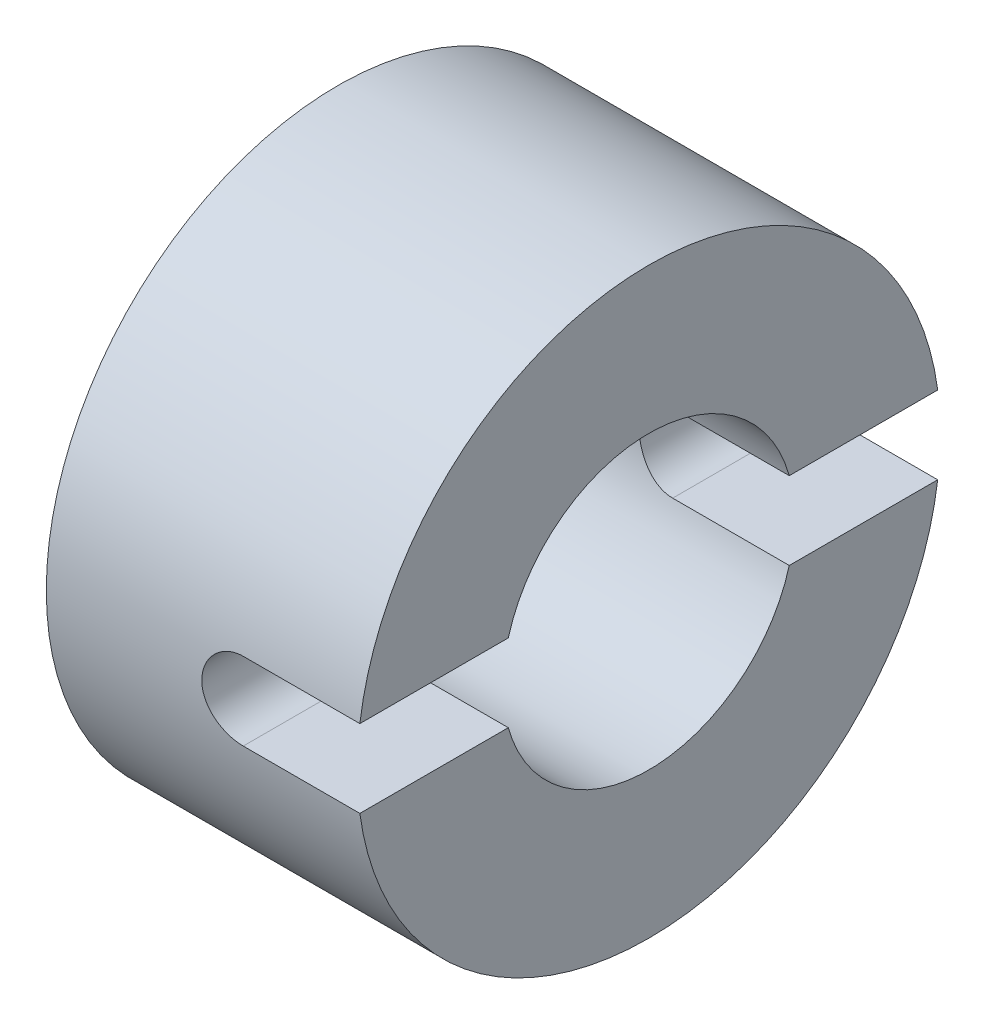
ISO-10303-21;
HEADER;
FILE_DESCRIPTION(('STEP AP214'),'2;1');
FILE_NAME('part.step','',(''),(''),'','','');
FILE_SCHEMA(('AUTOMOTIVE_DESIGN { 1 0 10303 214 1 1 1 1 }'));
ENDSEC;
DATA;
#1=APPLICATION_CONTEXT('core data for automotive mechanical design processes');
#2=APPLICATION_PROTOCOL_DEFINITION('international standard','automotive_design',2000,#1);
#3=PRODUCT_CONTEXT('',#1,'mechanical');
#4=PRODUCT('Part','Part','',(#3));
#5=PRODUCT_RELATED_PRODUCT_CATEGORY('part','',(#4));
#6=PRODUCT_DEFINITION_FORMATION('','',#4);
#7=PRODUCT_DEFINITION_CONTEXT('part definition',#1,'design');
#8=PRODUCT_DEFINITION('design','',#6,#7);
#9=PRODUCT_DEFINITION_SHAPE('','',#8);
#10=(LENGTH_UNIT() NAMED_UNIT(*) SI_UNIT(.MILLI.,.METRE.));
#11=(NAMED_UNIT(*) PLANE_ANGLE_UNIT() SI_UNIT($,.RADIAN.));
#12=(NAMED_UNIT(*) SI_UNIT($,.STERADIAN.) SOLID_ANGLE_UNIT());
#13=UNCERTAINTY_MEASURE_WITH_UNIT(LENGTH_MEASURE(1.E-05),#10,'distance_accuracy_value','');
#14=(GEOMETRIC_REPRESENTATION_CONTEXT(3) GLOBAL_UNCERTAINTY_ASSIGNED_CONTEXT((#13)) GLOBAL_UNIT_ASSIGNED_CONTEXT((#10,
#11,#12)) REPRESENTATION_CONTEXT('',''));
#15=CARTESIAN_POINT('',(0.,0.,0.));
#16=DIRECTION('',(0.,0.,1.));
#17=DIRECTION('',(1.,0.,0.));
#18=AXIS2_PLACEMENT_3D('',#15,#16,#17);
#19=CARTESIAN_POINT('',(-26.499793814433,0.,0.));
#20=DIRECTION('',(-1.,0.,0.));
#21=DIRECTION('',(0.,0.,1.));
#22=AXIS2_PLACEMENT_3D('',#19,#20,#21);
#23=CYLINDRICAL_SURFACE('',#22,7.5);
#24=CARTESIAN_POINT('',(-12.673814,0.,0.));
#25=DIRECTION('',(-1.,0.,0.));
#26=DIRECTION('',(0.,0.,1.));
#27=AXIS2_PLACEMENT_3D('',#24,#25,#26);
#28=CIRCLE('',#27,7.5);
#29=CARTESIAN_POINT('',(-12.673814,0.,7.5));
#30=VERTEX_POINT('',#29);
#31=EDGE_CURVE('E136',#30,#30,#28,.T.);
#32=ORIENTED_EDGE('',*,*,#31,.F.);
#33=EDGE_LOOP('',(#32));
#34=FACE_BOUND('',#33,.T.);
#35=DIRECTION('',(-1.,0.,0.));
#36=VECTOR('',#35,1.);
#37=CARTESIAN_POINT('',(-26.499793814433,1.,7.43303437365925));
#38=LINE('',#37,#36);
#39=CARTESIAN_POINT('',(-4.673814,1.,7.43303437365925));
#40=VERTEX_POINT('',#39);
#41=CARTESIAN_POINT('',(-7.673814,1.,7.43303437365925));
#42=VERTEX_POINT('',#41);
#43=EDGE_CURVE('E121',#40,#42,#38,.T.);
#44=ORIENTED_EDGE('',*,*,#43,.F.);
#45=CARTESIAN_POINT('',(-4.673814,0.,0.));
#46=DIRECTION('',(-1.,0.,0.));
#47=DIRECTION('',(0.,0.,1.));
#48=AXIS2_PLACEMENT_3D('',#45,#46,#47);
#49=CIRCLE('',#48,7.5);
#50=CARTESIAN_POINT('',(-4.673814,1.,-7.43303437365925));
#51=VERTEX_POINT('',#50);
#52=EDGE_CURVE('E117',#40,#51,#49,.T.);
#53=ORIENTED_EDGE('',*,*,#52,.T.);
#54=DIRECTION('',(-1.,0.,0.));
#55=VECTOR('',#54,1.);
#56=CARTESIAN_POINT('',(-26.499793814433,1.,-7.43303437365925));
#57=LINE('',#56,#55);
#58=CARTESIAN_POINT('',(-7.673814,1.,-7.43303437365925));
#59=VERTEX_POINT('',#58);
#60=EDGE_CURVE('E107',#59,#51,#57,.F.);
#61=ORIENTED_EDGE('',*,*,#60,.F.);
#62=CARTESIAN_POINT('',(-6.673814,0.,-7.5));
#63=CARTESIAN_POINT('',(-6.67381635485345,0.0559044178346422,-7.49999917871272));
#64=CARTESIAN_POINT('',(-6.67851776898123,0.11184298963814,-7.49936835363597));
#65=CARTESIAN_POINT('',(-6.69719717452478,0.222161362569039,-7.49691255563452));
#66=CARTESIAN_POINT('',(-6.71118464744857,0.276539511166518,-7.49508636220862));
#67=CARTESIAN_POINT('',(-6.74801485877072,0.382124156313492,-7.49044539924533));
#68=CARTESIAN_POINT('',(-6.77085140551922,0.433332841529247,-7.48763132105486));
#69=CARTESIAN_POINT('',(-6.82471745690314,0.531181947515149,-7.48132693330196));
#70=CARTESIAN_POINT('',(-6.85574564058323,0.577823103168513,-7.47783673279283));
#71=CARTESIAN_POINT('',(-6.92532063080209,0.665512911252339,-7.47054497394982));
#72=CARTESIAN_POINT('',(-6.96390832250423,0.706528992747932,-7.46674179081055));
#73=CARTESIAN_POINT('',(-7.04741909453833,0.781523678365509,-7.45926568778975));
#74=CARTESIAN_POINT('',(-7.0923425099979,0.815501909986106,-7.45559277481171));
#75=CARTESIAN_POINT('',(-7.18746356147251,0.875579511344537,-7.44877717720095));
#76=CARTESIAN_POINT('',(-7.23768084123931,0.901648037412889,-7.44563658882881));
#77=CARTESIAN_POINT('',(-7.34182953361839,0.944969225036451,-7.44026293689616));
#78=CARTESIAN_POINT('',(-7.39576078617666,0.96222226622639,-7.43802983425604));
#79=CARTESIAN_POINT('',(-7.50546690525083,0.987323033860869,-7.43473968284334));
#80=CARTESIAN_POINT('',(-7.56122891726646,0.995226021142532,-7.43367572685068));
#81=CARTESIAN_POINT('',(-7.67329708980297,1.00157340274059,-7.43282325804657));
#82=CARTESIAN_POINT('',(-7.72960322540545,1.00001822816801,-7.433034687102));
#83=CARTESIAN_POINT('',(-7.84077456501396,0.987538729696172,-7.43470277886495));
#84=CARTESIAN_POINT('',(-7.89564676494285,0.976675487658808,-7.43615132311171));
#85=CARTESIAN_POINT('',(-8.00278241838004,0.945983623171857,-7.44011776387373));
#86=CARTESIAN_POINT('',(-8.0550458123775,0.926154796307287,-7.44263568477064));
#87=CARTESIAN_POINT('',(-8.1556688173536,0.878029645715956,-7.44846630555513));
#88=CARTESIAN_POINT('',(-8.20401568559715,0.849706989568746,-7.45178147061949));
#89=CARTESIAN_POINT('',(-8.29529354095883,0.785416966721446,-7.45883118109967));
#90=CARTESIAN_POINT('',(-8.33822424627708,0.749449202511925,-7.46256574831765));
#91=CARTESIAN_POINT('',(-8.41780550629095,0.670552450131812,-7.47006949616793));
#92=CARTESIAN_POINT('',(-8.45440392135116,0.627570853513222,-7.47383871770599));
#93=CARTESIAN_POINT('',(-8.51987502246419,0.536047085066703,-7.48095961909132));
#94=CARTESIAN_POINT('',(-8.54874768626176,0.487504897221184,-7.48431129773577));
#95=CARTESIAN_POINT('',(-8.59794855884737,0.386196109865234,-7.4902219687179));
#96=CARTESIAN_POINT('',(-8.61827326552315,0.333427789420614,-7.49278063604478));
#97=CARTESIAN_POINT('',(-8.64975865948617,0.225185462168124,-7.49681412952036));
#98=CARTESIAN_POINT('',(-8.66091983531969,0.169711599771128,-7.49828901344964));
#99=CARTESIAN_POINT('',(-8.67369321638556,0.0580834516628215,-7.49998120688428));
#100=CARTESIAN_POINT('',(-8.67537720089174,0.00193751727352087,-7.50020796924523));
#101=CARTESIAN_POINT('',(-8.66933816793641,-0.109835808609359,-7.49940395769259));
#102=CARTESIAN_POINT('',(-8.66161537910882,-0.165463212672832,-7.49837321434299));
#103=CARTESIAN_POINT('',(-8.63704167330801,-0.274406857786469,-7.4951758767905));
#104=CARTESIAN_POINT('',(-8.62022521583892,-0.327731008256023,-7.49301357151461));
#105=CARTESIAN_POINT('',(-8.57797751703145,-0.43080254939678,-7.48779504627144));
#106=CARTESIAN_POINT('',(-8.55254594699337,-0.480549803507819,-7.4847387921972));
#107=CARTESIAN_POINT('',(-8.49361792220834,-0.57537443930804,-7.47804918685037));
#108=CARTESIAN_POINT('',(-8.46007531714333,-0.620422907198303,-7.47441257522858));
#109=CARTESIAN_POINT('',(-8.38594233538787,-0.704276473495949,-7.46697864354991));
#110=CARTESIAN_POINT('',(-8.34535163874178,-0.743081288311893,-7.4631813162031));
#111=CARTESIAN_POINT('',(-8.25795742868022,-0.813602747115491,-7.45582451236755));
#112=CARTESIAN_POINT('',(-8.21111521663092,-0.845271638044691,-7.45226674387649));
#113=CARTESIAN_POINT('',(-8.11273429485954,-0.900291755394069,-7.44582066500908));
#114=CARTESIAN_POINT('',(-8.06119569004481,-0.923643167551732,-7.44293233968392));
#115=CARTESIAN_POINT('',(-7.95503537898615,-0.961289182503731,-7.43816405890039));
#116=CARTESIAN_POINT('',(-7.9004231573946,-0.975610144233977,-7.43628117116299));
#117=CARTESIAN_POINT('',(-7.78954218393562,-0.994873335719794,-7.43372874349146));
#118=CARTESIAN_POINT('',(-7.73327352083778,-0.999816067133909,-7.43305913865671));
#119=CARTESIAN_POINT('',(-7.62115225457324,-1.00017242903095,-7.43301115647724));
#120=CARTESIAN_POINT('',(-7.56529987951788,-0.995661095972463,-7.4336226114126));
#121=CARTESIAN_POINT('',(-7.45515506244806,-0.977396883433445,-7.43604591937099));
#122=CARTESIAN_POINT('',(-7.40086261984901,-0.963644007416343,-7.43785777194415));
#123=CARTESIAN_POINT('',(-7.2953921583742,-0.927311551661036,-7.44247445136382));
#124=CARTESIAN_POINT('',(-7.24421269444157,-0.904736104095205,-7.445278813297));
#125=CARTESIAN_POINT('',(-7.14635605808697,-0.851406713798686,-7.45156522856411));
#126=CARTESIAN_POINT('',(-7.09967897262198,-0.820652613152143,-7.45504729498301));
#127=CARTESIAN_POINT('',(-7.01176917503579,-0.751562242547542,-7.46232983591531));
#128=CARTESIAN_POINT('',(-6.97058052612243,-0.713170136134504,-7.46613252877041));
#129=CARTESIAN_POINT('',(-6.89520239181923,-0.630010846749118,-7.47360859500832));
#130=CARTESIAN_POINT('',(-6.86101455062487,-0.585242170364888,-7.47728193784489));
#131=CARTESIAN_POINT('',(-6.80048043076674,-0.490376493926411,-7.48410317568764));
#132=CARTESIAN_POINT('',(-6.77416866672238,-0.440257310371983,-7.48724873213445));
#133=CARTESIAN_POINT('',(-6.73037370072746,-0.336296204793664,-7.49263660329486));
#134=CARTESIAN_POINT('',(-6.71288104568757,-0.282458339484944,-7.49487988462156));
#135=CARTESIAN_POINT('',(-6.69133999680741,-0.190294204049209,-7.49767860871633));
#136=CARTESIAN_POINT('',(-6.68477737823818,-0.152545540977889,-7.49854481817537));
#137=CARTESIAN_POINT('',(-6.67601359291726,-0.0765365858080559,-7.49970579245385));
#138=CARTESIAN_POINT('',(-6.6738123876932,-0.0382762982256202,-7.500000562314));
#139=CARTESIAN_POINT('',(-6.673814,0.,-7.5));
#140=B_SPLINE_CURVE_WITH_KNOTS('',3,(#62,#63,#64,#65,#66,#67,#68,#69,#70,#71,#72,#73,#74,#75,
#76,#77,#78,#79,#80,#81,#82,#83,#84,#85,#86,#87,#88,#89,#90,#91,#92,#93,#94,#95,#96,#97,#98,#99,
#100,#101,#102,#103,#104,#105,#106,#107,#108,#109,#110,#111,#112,#113,#114,#115,#116,#117,#118,
#119,#120,#121,#122,#123,#124,#125,#126,#127,#128,#129,#130,#131,#132,#133,#134,#135,#136,#137,
#138,#139),.UNSPECIFIED.,.T.,.F.,(4,2,2,2,2,2,2,2,2,2,2,2,2,2,2,2,2,2,2,2,2,2,2,2,2,2,2,2,2,2,2,
2,2,2,2,2,2,2,4),(0.,0.167573425652872,0.335318215442522,0.502945846413702,0.670546462820173,
0.839079892217795,1.00762223952418,1.17681360755824,1.34599768883102,1.51417677957179,
1.6823482046246,1.84942442549022,2.01650445587925,2.18410791568949,2.35172009221899,
2.52065272242425,2.68958583926148,2.85858810101269,3.02758135195871,3.1952929249603,
3.36300042177239,3.53007681698232,3.69715958751773,3.86521637384942,4.03328079129381,
4.20243852267725,4.37159247636524,4.54025037367727,4.70889924891817,4.87621463748312,
5.04352996334373,5.21076701851311,5.37800730297951,5.54651833917553,5.7150689062558,
5.88434763337258,6.05344452496209,6.16817869523654,6.28291185342719),.UNSPECIFIED.);
#141=CARTESIAN_POINT('',(-7.673814,-0.999999999999999,-7.43303437365925));
#142=VERTEX_POINT('',#141);
#143=EDGE_CURVE('E96',#59,#142,#140,.T.);
#144=ORIENTED_EDGE('',*,*,#143,.T.);
#145=DIRECTION('',(-1.,0.,0.));
#146=VECTOR('',#145,1.);
#147=CARTESIAN_POINT('',(-26.499793814433,-1.,-7.43303437365925));
#148=LINE('',#147,#146);
#149=CARTESIAN_POINT('',(-4.673814,-0.999999999999999,-7.43303437365925));
#150=VERTEX_POINT('',#149);
#151=EDGE_CURVE('E123',#150,#142,#148,.T.);
#152=ORIENTED_EDGE('',*,*,#151,.F.);
#153=CARTESIAN_POINT('',(-4.673814,-0.999999999999999,7.43303437365925));
#154=VERTEX_POINT('',#153);
#155=EDGE_CURVE('E134',#150,#154,#49,.T.);
#156=ORIENTED_EDGE('',*,*,#155,.T.);
#157=DIRECTION('',(-1.,0.,0.));
#158=VECTOR('',#157,1.);
#159=CARTESIAN_POINT('',(-26.499793814433,-1.,7.43303437365925));
#160=LINE('',#159,#158);
#161=CARTESIAN_POINT('',(-7.673814,-0.999999999999999,7.43303437365925));
#162=VERTEX_POINT('',#161);
#163=EDGE_CURVE('E198',#162,#154,#160,.F.);
#164=ORIENTED_EDGE('',*,*,#163,.F.);
#165=CARTESIAN_POINT('',(-6.673814,0.,7.5));
#166=CARTESIAN_POINT('',(-6.67381635485345,-0.0559044178346421,7.49999917871272));
#167=CARTESIAN_POINT('',(-6.67851776898123,-0.11184298963814,7.49936835363597));
#168=CARTESIAN_POINT('',(-6.69719717452478,-0.222161362569039,7.49691255563452));
#169=CARTESIAN_POINT('',(-6.71118464744857,-0.276539511166518,7.49508636220862));
#170=CARTESIAN_POINT('',(-6.74801485877072,-0.382124156313492,7.49044539924533));
#171=CARTESIAN_POINT('',(-6.77085140551922,-0.433332841529247,7.48763132105486));
#172=CARTESIAN_POINT('',(-6.82471745690314,-0.531181947515149,7.48132693330196));
#173=CARTESIAN_POINT('',(-6.85574564058323,-0.577823103168513,7.47783673279283));
#174=CARTESIAN_POINT('',(-6.92532063080209,-0.665512911252339,7.47054497394982));
#175=CARTESIAN_POINT('',(-6.96390832250423,-0.706528992747932,7.46674179081055));
#176=CARTESIAN_POINT('',(-7.04741909453833,-0.781523678365509,7.45926568778975));
#177=CARTESIAN_POINT('',(-7.0923425099979,-0.815501909986106,7.45559277481171));
#178=CARTESIAN_POINT('',(-7.18746356147251,-0.875579511344537,7.44877717720095));
#179=CARTESIAN_POINT('',(-7.23768084123931,-0.901648037412889,7.44563658882881));
#180=CARTESIAN_POINT('',(-7.34182953361839,-0.944969225036451,7.44026293689616));
#181=CARTESIAN_POINT('',(-7.39576078617666,-0.96222226622639,7.43802983425604));
#182=CARTESIAN_POINT('',(-7.50546690525083,-0.987323033860869,7.43473968284334));
#183=CARTESIAN_POINT('',(-7.56122891726646,-0.995226021142532,7.43367572685068));
#184=CARTESIAN_POINT('',(-7.67329708980298,-1.00157340274059,7.43282325804657));
#185=CARTESIAN_POINT('',(-7.72960322540545,-1.00001822816801,7.433034687102));
#186=CARTESIAN_POINT('',(-7.84077456501396,-0.987538729696172,7.43470277886495));
#187=CARTESIAN_POINT('',(-7.89564676494285,-0.976675487658808,7.43615132311171));
#188=CARTESIAN_POINT('',(-8.00278241838004,-0.945983623171857,7.44011776387373));
#189=CARTESIAN_POINT('',(-8.0550458123775,-0.926154796307287,7.44263568477064));
#190=CARTESIAN_POINT('',(-8.1556688173536,-0.878029645715956,7.44846630555513));
#191=CARTESIAN_POINT('',(-8.20401568559715,-0.849706989568746,7.45178147061949));
#192=CARTESIAN_POINT('',(-8.29529354095883,-0.785416966721446,7.45883118109967));
#193=CARTESIAN_POINT('',(-8.33822424627708,-0.749449202511924,7.46256574831765));
#194=CARTESIAN_POINT('',(-8.41780550629095,-0.670552450131811,7.47006949616793));
#195=CARTESIAN_POINT('',(-8.45440392135116,-0.627570853513222,7.47383871770599));
#196=CARTESIAN_POINT('',(-8.51987502246419,-0.536047085066703,7.48095961909132));
#197=CARTESIAN_POINT('',(-8.54874768626176,-0.487504897221184,7.48431129773577));
#198=CARTESIAN_POINT('',(-8.59794855884737,-0.386196109865234,7.4902219687179));
#199=CARTESIAN_POINT('',(-8.61827326552315,-0.333427789420614,7.49278063604478));
#200=CARTESIAN_POINT('',(-8.64975865948617,-0.225185462168123,7.49681412952036));
#201=CARTESIAN_POINT('',(-8.66091983531969,-0.169711599771128,7.49828901344964));
#202=CARTESIAN_POINT('',(-8.67369321638556,-0.0580834516628215,7.49998120688428));
#203=CARTESIAN_POINT('',(-8.67537720089174,-0.00193751727352087,7.50020796924523));
#204=CARTESIAN_POINT('',(-8.66933816793641,0.109835808609359,7.49940395769259));
#205=CARTESIAN_POINT('',(-8.66161537910882,0.165463212672832,7.49837321434299));
#206=CARTESIAN_POINT('',(-8.63704167330801,0.274406857786469,7.4951758767905));
#207=CARTESIAN_POINT('',(-8.62022521583892,0.327731008256023,7.49301357151461));
#208=CARTESIAN_POINT('',(-8.57797751703145,0.43080254939678,7.48779504627144));
#209=CARTESIAN_POINT('',(-8.55254594699337,0.480549803507819,7.4847387921972));
#210=CARTESIAN_POINT('',(-8.49361792220834,0.57537443930804,7.47804918685037));
#211=CARTESIAN_POINT('',(-8.46007531714333,0.620422907198303,7.47441257522858));
#212=CARTESIAN_POINT('',(-8.38594233538787,0.704276473495949,7.46697864354991));
#213=CARTESIAN_POINT('',(-8.34535163874178,0.743081288311893,7.4631813162031));
#214=CARTESIAN_POINT('',(-8.25795742868022,0.813602747115491,7.45582451236755));
#215=CARTESIAN_POINT('',(-8.21111521663092,0.845271638044691,7.45226674387649));
#216=CARTESIAN_POINT('',(-8.11273429485954,0.900291755394069,7.44582066500908));
#217=CARTESIAN_POINT('',(-8.06119569004481,0.923643167551732,7.44293233968392));
#218=CARTESIAN_POINT('',(-7.95503537898615,0.961289182503731,7.43816405890039));
#219=CARTESIAN_POINT('',(-7.9004231573946,0.975610144233977,7.43628117116299));
#220=CARTESIAN_POINT('',(-7.78954218393562,0.994873335719794,7.43372874349146));
#221=CARTESIAN_POINT('',(-7.73327352083778,0.999816067133909,7.43305913865671));
#222=CARTESIAN_POINT('',(-7.62115225457324,1.00017242903095,7.43301115647724));
#223=CARTESIAN_POINT('',(-7.56529987951788,0.995661095972463,7.4336226114126));
#224=CARTESIAN_POINT('',(-7.45515506244806,0.977396883433445,7.43604591937099));
#225=CARTESIAN_POINT('',(-7.40086261984901,0.963644007416343,7.43785777194415));
#226=CARTESIAN_POINT('',(-7.2953921583742,0.927311551661036,7.44247445136382));
#227=CARTESIAN_POINT('',(-7.24421269444157,0.904736104095205,7.445278813297));
#228=CARTESIAN_POINT('',(-7.14635605808697,0.851406713798686,7.45156522856411));
#229=CARTESIAN_POINT('',(-7.09967897262198,0.820652613152143,7.45504729498301));
#230=CARTESIAN_POINT('',(-7.01176917503579,0.751562242547542,7.46232983591531));
#231=CARTESIAN_POINT('',(-6.97058052612243,0.713170136134504,7.46613252877041));
#232=CARTESIAN_POINT('',(-6.89520239181923,0.630010846749118,7.47360859500832));
#233=CARTESIAN_POINT('',(-6.86101455062487,0.585242170364888,7.47728193784489));
#234=CARTESIAN_POINT('',(-6.80048043076674,0.490376493926411,7.48410317568764));
#235=CARTESIAN_POINT('',(-6.77416866672238,0.440257310371983,7.48724873213445));
#236=CARTESIAN_POINT('',(-6.73037370072746,0.336296204793664,7.49263660329486));
#237=CARTESIAN_POINT('',(-6.71288104568757,0.282458339484944,7.49487988462156));
#238=CARTESIAN_POINT('',(-6.69133999680741,0.190294204049209,7.49767860871633));
#239=CARTESIAN_POINT('',(-6.68477737823818,0.152545540977889,7.49854481817537));
#240=CARTESIAN_POINT('',(-6.67601359291726,0.0765365858080553,7.49970579245385));
#241=CARTESIAN_POINT('',(-6.6738123876932,0.0382762982256199,7.500000562314));
#242=CARTESIAN_POINT('',(-6.673814,0.,7.5));
#243=B_SPLINE_CURVE_WITH_KNOTS('',3,(#165,#166,#167,#168,#169,#170,#171,#172,#173,#174,#175,
#176,#177,#178,#179,#180,#181,#182,#183,#184,#185,#186,#187,#188,#189,#190,#191,#192,#193,#194,
#195,#196,#197,#198,#199,#200,#201,#202,#203,#204,#205,#206,#207,#208,#209,#210,#211,#212,#213,
#214,#215,#216,#217,#218,#219,#220,#221,#222,#223,#224,#225,#226,#227,#228,#229,#230,#231,#232,
#233,#234,#235,#236,#237,#238,#239,#240,#241,#242),.UNSPECIFIED.,.T.,.F.,(4,2,2,2,2,2,2,2,2,2,2,
2,2,2,2,2,2,2,2,2,2,2,2,2,2,2,2,2,2,2,2,2,2,2,2,2,2,2,4),(0.,0.167573425652872,
0.335318215442522,0.502945846413703,0.670546462820173,0.839079892217795,1.00762223952418,
1.17681360755824,1.34599768883102,1.5141767795718,1.6823482046246,1.84942442549022,
2.01650445587925,2.18410791568949,2.35172009221899,2.52065272242425,2.68958583926148,
2.85858810101269,3.02758135195871,3.1952929249603,3.36300042177239,3.53007681698232,
3.69715958751773,3.86521637384942,4.03328079129381,4.20243852267725,4.37159247636524,
4.54025037367727,4.70889924891817,4.87621463748312,5.04352996334373,5.21076701851311,
5.37800730297951,5.54651833917553,5.7150689062558,5.88434763337258,6.05344452496209,
6.16817869523654,6.28291185342719),.UNSPECIFIED.);
#244=EDGE_CURVE('E103',#162,#42,#243,.T.);
#245=ORIENTED_EDGE('',*,*,#244,.T.);
#246=EDGE_LOOP('',(#44,#53,#61,#144,#152,#156,#164,#245));
#247=FACE_BOUND('',#246,.T.);
#248=ADVANCED_FACE('F33',(#34,#247),#23,.T.);
#249=CARTESIAN_POINT('',(-4.673814,7.5,0.));
#250=DIRECTION('',(-1.,0.,0.));
#251=DIRECTION('',(0.,0.,1.));
#252=AXIS2_PLACEMENT_3D('',#249,#250,#251);
#253=PLANE('',#252);
#254=DIRECTION('',(0.,0.,1.));
#255=VECTOR('',#254,1.);
#256=CARTESIAN_POINT('',(-4.673814,1.,0.));
#257=LINE('',#256,#255);
#258=CARTESIAN_POINT('',(-4.673814,1.,-3.61420807370024));
#259=VERTEX_POINT('',#258);
#260=EDGE_CURVE('E119',#51,#259,#257,.T.);
#261=ORIENTED_EDGE('',*,*,#260,.F.);
#262=ORIENTED_EDGE('',*,*,#52,.F.);
#263=CARTESIAN_POINT('',(-4.673814,1.,3.61420807370024));
#264=VERTEX_POINT('',#263);
#265=EDGE_CURVE('E118',#264,#40,#257,.T.);
#266=ORIENTED_EDGE('',*,*,#265,.F.);
#267=CARTESIAN_POINT('',(-4.673814,0.,0.));
#268=DIRECTION('',(-1.,0.,0.));
#269=DIRECTION('',(0.,0.,1.));
#270=AXIS2_PLACEMENT_3D('',#267,#268,#269);
#271=CIRCLE('',#270,3.75);
#272=EDGE_CURVE('E131',#264,#259,#271,.T.);
#273=ORIENTED_EDGE('',*,*,#272,.T.);
#274=EDGE_LOOP('',(#261,#262,#266,#273));
#275=FACE_BOUND('',#274,.T.);
#276=ADVANCED_FACE('F174',(#275),#253,.F.);
#277=DIRECTION('',(0.,0.,-1.));
#278=VECTOR('',#277,1.);
#279=CARTESIAN_POINT('',(-4.673814,-0.999999999999999,0.));
#280=LINE('',#279,#278);
#281=CARTESIAN_POINT('',(-4.673814,-1.,3.61420807370024));
#282=VERTEX_POINT('',#281);
#283=EDGE_CURVE('E199',#154,#282,#280,.T.);
#284=ORIENTED_EDGE('',*,*,#283,.F.);
#285=ORIENTED_EDGE('',*,*,#155,.F.);
#286=CARTESIAN_POINT('',(-4.673814,-1.,-3.61420807370024));
#287=VERTEX_POINT('',#286);
#288=EDGE_CURVE('E192',#287,#150,#280,.T.);
#289=ORIENTED_EDGE('',*,*,#288,.F.);
#290=EDGE_CURVE('E130',#287,#282,#271,.T.);
#291=ORIENTED_EDGE('',*,*,#290,.T.);
#292=EDGE_LOOP('',(#284,#285,#289,#291));
#293=FACE_BOUND('',#292,.T.);
#294=ADVANCED_FACE('F178',(#293),#253,.F.);
#295=CARTESIAN_POINT('',(-26.499793814433,0.,0.));
#296=DIRECTION('',(-1.,0.,0.));
#297=DIRECTION('',(0.,0.,1.));
#298=AXIS2_PLACEMENT_3D('',#295,#296,#297);
#299=CYLINDRICAL_SURFACE('',#298,3.75);
#300=CARTESIAN_POINT('',(-12.673814,0.,0.));
#301=DIRECTION('',(-1.,0.,0.));
#302=DIRECTION('',(0.,0.,1.));
#303=AXIS2_PLACEMENT_3D('',#300,#301,#302);
#304=CIRCLE('',#303,3.75);
#305=CARTESIAN_POINT('',(-12.673814,0.,3.75));
#306=VERTEX_POINT('',#305);
#307=EDGE_CURVE('E127',#306,#306,#304,.T.);
#308=ORIENTED_EDGE('',*,*,#307,.T.);
#309=EDGE_LOOP('',(#308));
#310=FACE_BOUND('',#309,.T.);
#311=DIRECTION('',(-1.,0.,0.));
#312=VECTOR('',#311,1.);
#313=CARTESIAN_POINT('',(-26.499793814433,1.,3.61420807370024));
#314=LINE('',#313,#312);
#315=CARTESIAN_POINT('',(-7.673814,1.,3.61420807370024));
#316=VERTEX_POINT('',#315);
#317=EDGE_CURVE('E11',#316,#264,#314,.F.);
#318=ORIENTED_EDGE('',*,*,#317,.F.);
#319=CARTESIAN_POINT('',(-6.673814,0.,3.75));
#320=CARTESIAN_POINT('',(-6.67381530846742,0.0551272779164271,3.74999916905081));
#321=CARTESIAN_POINT('',(-6.67838780709483,0.11026858011092,3.74877243081077));
#322=CARTESIAN_POINT('',(-6.69652461536935,0.218962725677231,3.74399786810828));
#323=CARTESIAN_POINT('',(-6.71009325221305,0.272514791659543,3.74044892666287));
#324=CARTESIAN_POINT('',(-6.74574983343202,0.376445794522656,3.73142166626401));
#325=CARTESIAN_POINT('',(-6.76782679383302,0.426828725507643,3.72594583565211));
#326=CARTESIAN_POINT('',(-6.8198326213333,0.523176843196328,3.71364349575816));
#327=CARTESIAN_POINT('',(-6.84976201167962,0.569141735224809,3.70681689647503));
#328=CARTESIAN_POINT('',(-6.91735575820671,0.656414751870012,3.69237307451086));
#329=CARTESIAN_POINT('',(-6.95516833400424,0.697605844931407,3.68474233839675));
#330=CARTESIAN_POINT('',(-7.03713824153157,0.773143568303175,3.66963704839461));
#331=CARTESIAN_POINT('',(-7.08129638880837,0.80748931747827,3.66216251472373));
#332=CARTESIAN_POINT('',(-7.17563811741312,0.868932046217128,3.64807768733456));
#333=CARTESIAN_POINT('',(-7.22591216413236,0.895894388682635,3.64148444286396));
#334=CARTESIAN_POINT('',(-7.33048405554471,0.940937740384771,3.63010738654318));
#335=CARTESIAN_POINT('',(-7.38478115616011,0.959020387256101,3.625323241088));
#336=CARTESIAN_POINT('',(-7.49456176891332,0.985384601132126,3.61824557918659));
#337=CARTESIAN_POINT('',(-7.54999076997607,0.993878351224681,3.61589823970153));
#338=CARTESIAN_POINT('',(-7.66153284166645,1.00148517353046,3.61379915522345));
#339=CARTESIAN_POINT('',(-7.71764578251781,1.00059999852868,3.61404692524201));
#340=CARTESIAN_POINT('',(-7.82730670768618,0.989642550013105,3.61706189384523));
#341=CARTESIAN_POINT('',(-7.88088259101902,0.979827030323719,3.61975867751345));
#342=CARTESIAN_POINT('',(-7.98559816722835,0.951698743611019,3.62725506544765));
#343=CARTESIAN_POINT('',(-8.03673766503773,0.933385297465002,3.63205483777497));
#344=CARTESIAN_POINT('',(-8.13579807190423,0.888571784826251,3.64327830872989));
#345=CARTESIAN_POINT('',(-8.18367616964311,0.861981705688915,3.64971971409029));
#346=CARTESIAN_POINT('',(-8.27438107942578,0.801432519118896,3.66349114821546));
#347=CARTESIAN_POINT('',(-8.31720689457824,0.767471961121259,3.67082135177681));
#348=CARTESIAN_POINT('',(-8.39805849872739,0.691833036317093,3.68583755314841));
#349=CARTESIAN_POINT('',(-8.43588215915747,0.649939063641495,3.69352735744391));
#350=CARTESIAN_POINT('',(-8.50400839017514,0.560308834103186,3.70818190638182));
#351=CARTESIAN_POINT('',(-8.53431066435121,0.512572347102545,3.71514662244284));
#352=CARTESIAN_POINT('',(-8.58662295141233,0.412299127748725,3.7276091019914));
#353=CARTESIAN_POINT('',(-8.6085963852243,0.359742451275894,3.73310036416778));
#354=CARTESIAN_POINT('',(-8.64333759440669,0.251501147195197,3.74195022200501));
#355=CARTESIAN_POINT('',(-8.65610738136198,0.195817205964161,3.74530928366875));
#356=CARTESIAN_POINT('',(-8.67176143845891,0.0846270415727575,3.74944579279192));
#357=CARTESIAN_POINT('',(-8.67492051992543,0.0291621188206898,3.75029498735481));
#358=CARTESIAN_POINT('',(-8.67202241787653,-0.0815050229505991,3.74952235845846));
#359=CARTESIAN_POINT('',(-8.66596618694712,-0.136707268531056,3.74790079040171));
#360=CARTESIAN_POINT('',(-8.64503477627001,-0.244301224950891,3.74241517748015));
#361=CARTESIAN_POINT('',(-8.6303128769011,-0.296724926013894,3.73859013273183));
#362=CARTESIAN_POINT('',(-8.59264602774604,-0.398353485588028,3.72913147447051));
#363=CARTESIAN_POINT('',(-8.56970018687477,-0.447557994607998,3.72349766498012));
#364=CARTESIAN_POINT('',(-8.51572705640968,-0.542419237333991,3.71087830279834));
#365=CARTESIAN_POINT('',(-8.48455026660096,-0.58798759423065,3.70386843302742));
#366=CARTESIAN_POINT('',(-8.41518818492117,-0.673342317698514,3.68930726182519));
#367=CARTESIAN_POINT('',(-8.37700150870011,-0.713127539399371,3.68175585362777));
#368=CARTESIAN_POINT('',(-8.29342121125206,-0.786944622394094,3.66669872934363));
#369=CARTESIAN_POINT('',(-8.24785471929993,-0.820782596249929,3.65920030718477));
#370=CARTESIAN_POINT('',(-8.15153165195267,-0.880335955924743,3.64533223587543));
#371=CARTESIAN_POINT('',(-8.10077529319813,-0.906051680607634,3.63896253963886));
#372=CARTESIAN_POINT('',(-7.99576634645589,-0.94843705793243,3.62814634200825));
#373=CARTESIAN_POINT('',(-7.94153609406344,-0.965159061279487,3.62368874211867));
#374=CARTESIAN_POINT('',(-7.83089434013309,-0.989206025603965,3.61719912616095));
#375=CARTESIAN_POINT('',(-7.77448339981646,-0.99653338801494,3.6151664902391));
#376=CARTESIAN_POINT('',(-7.66306660606372,-1.00144494826626,3.61380872273343));
#377=CARTESIAN_POINT('',(-7.60807533987236,-0.999340778089926,3.61439698868016));
#378=CARTESIAN_POINT('',(-7.49926224299348,-0.986171880002812,3.61801198044147));
#379=CARTESIAN_POINT('',(-7.44544038224931,-0.975107382675292,3.62103864350682));
#380=CARTESIAN_POINT('',(-7.34088612393547,-0.944512578498333,3.62913785535625));
#381=CARTESIAN_POINT('',(-7.29013307863401,-0.925048305377856,3.63419442509566));
#382=CARTESIAN_POINT('',(-7.19257458473282,-0.878257772811974,3.64578409068345));
#383=CARTESIAN_POINT('',(-7.14576975684972,-0.850930280123095,3.65231741810752));
#384=CARTESIAN_POINT('',(-7.05594882025172,-0.788244546344072,3.66636460720159));
#385=CARTESIAN_POINT('',(-7.0130847325119,-0.752673648839543,3.67390166550826));
#386=CARTESIAN_POINT('',(-6.93383277416633,-0.674915267555503,3.68897751891523));
#387=CARTESIAN_POINT('',(-6.89744648066557,-0.632726177179374,3.69651631399226));
#388=CARTESIAN_POINT('',(-6.83141788117657,-0.541839990544341,3.71093906201979));
#389=CARTESIAN_POINT('',(-6.80193649467533,-0.493022980875889,3.71780555657274));
#390=CARTESIAN_POINT('',(-6.75164529203532,-0.390944320208445,3.7299190505145));
#391=CARTESIAN_POINT('',(-6.7308299121682,-0.337685547348148,3.73516708841798));
#392=CARTESIAN_POINT('',(-6.70117635729224,-0.237187352440495,3.74277376256734));
#393=CARTESIAN_POINT('',(-6.69093930820375,-0.190381008282517,3.74546385296301));
#394=CARTESIAN_POINT('',(-6.67725789691647,-0.0957198976585376,3.74907724518228));
#395=CARTESIAN_POINT('',(-6.67381286389999,-0.0478652352024299,3.75000072148635));
#396=CARTESIAN_POINT('',(-6.673814,0.,3.75));
#397=B_SPLINE_CURVE_WITH_KNOTS('',3,(#319,#320,#321,#322,#323,#324,#325,#326,#327,#328,#329,
#330,#331,#332,#333,#334,#335,#336,#337,#338,#339,#340,#341,#342,#343,#344,#345,#346,#347,#348,
#349,#350,#351,#352,#353,#354,#355,#356,#357,#358,#359,#360,#361,#362,#363,#364,#365,#366,#367,
#368,#369,#370,#371,#372,#373,#374,#375,#376,#377,#378,#379,#380,#381,#382,#383,#384,#385,#386,
#387,#388,#389,#390,#391,#392,#393,#394,#395,#396),.UNSPECIFIED.,.T.,.F.,(4,2,2,2,2,2,2,2,2,2,2,
2,2,2,2,2,2,2,2,2,2,2,2,2,2,2,2,2,2,2,2,2,2,2,2,2,2,2,4),(0.,0.165206299474784,
0.330492121880725,0.495565276485966,0.660649433543376,0.829174489774835,0.997721224625745,
1.16916291261614,1.3405729706485,1.50811079123794,1.67561730199242,1.83845501020081,
2.00130573403552,2.16599336670331,2.33071344055897,2.50080629903243,2.67090585965881,
2.84174404798603,3.01254488592152,3.17841358759356,3.34426514459758,3.5072676781814,
3.67028787884889,3.83650142999357,4.00274784126526,4.17368248188476,4.34460999009136,
4.51453148845744,4.68440954326913,4.84871671196727,5.01301965255219,5.17605382719073,
5.33911358556423,5.50697169780616,5.67487062161146,5.8463612613537,6.01774163067512,
6.1611990949159,6.30464238978113),.UNSPECIFIED.);
#398=CARTESIAN_POINT('',(-7.673814,-1.,3.61420807370024));
#399=VERTEX_POINT('',#398);
#400=EDGE_CURVE('E163',#316,#399,#397,.T.);
#401=ORIENTED_EDGE('',*,*,#400,.T.);
#402=DIRECTION('',(-1.,0.,0.));
#403=VECTOR('',#402,1.);
#404=CARTESIAN_POINT('',(-26.499793814433,-1.,3.61420807370024));
#405=LINE('',#404,#403);
#406=EDGE_CURVE('E41',#282,#399,#405,.T.);
#407=ORIENTED_EDGE('',*,*,#406,.F.);
#408=ORIENTED_EDGE('',*,*,#290,.F.);
#409=DIRECTION('',(-1.,0.,0.));
#410=VECTOR('',#409,1.);
#411=CARTESIAN_POINT('',(-26.499793814433,-1.,-3.61420807370024));
#412=LINE('',#411,#410);
#413=CARTESIAN_POINT('',(-7.673814,-0.999999999999999,-3.61420807370024));
#414=VERTEX_POINT('',#413);
#415=EDGE_CURVE('E145',#414,#287,#412,.F.);
#416=ORIENTED_EDGE('',*,*,#415,.F.);
#417=CARTESIAN_POINT('',(-6.673814,0.,-3.75));
#418=CARTESIAN_POINT('',(-6.67381530846743,-0.0551272779164272,-3.74999916905081));
#419=CARTESIAN_POINT('',(-6.67838780709484,-0.11026858011092,-3.74877243081077));
#420=CARTESIAN_POINT('',(-6.69652461536935,-0.218962725677232,-3.74399786810828));
#421=CARTESIAN_POINT('',(-6.71009325221305,-0.272514791659543,-3.74044892666287));
#422=CARTESIAN_POINT('',(-6.74574983343202,-0.376445794522656,-3.73142166626401));
#423=CARTESIAN_POINT('',(-6.76782679383302,-0.426828725507643,-3.72594583565211));
#424=CARTESIAN_POINT('',(-6.8198326213333,-0.523176843196329,-3.71364349575816));
#425=CARTESIAN_POINT('',(-6.84976201167962,-0.569141735224809,-3.70681689647503));
#426=CARTESIAN_POINT('',(-6.91735575820671,-0.656414751870012,-3.69237307451086));
#427=CARTESIAN_POINT('',(-6.95516833400424,-0.697605844931407,-3.68474233839675));
#428=CARTESIAN_POINT('',(-7.03713824153157,-0.773143568303175,-3.66963704839461));
#429=CARTESIAN_POINT('',(-7.08129638880837,-0.80748931747827,-3.66216251472373));
#430=CARTESIAN_POINT('',(-7.17563811741312,-0.868932046217128,-3.64807768733456));
#431=CARTESIAN_POINT('',(-7.22591216413236,-0.895894388682636,-3.64148444286396));
#432=CARTESIAN_POINT('',(-7.33048405554471,-0.940937740384771,-3.63010738654318));
#433=CARTESIAN_POINT('',(-7.38478115616011,-0.959020387256101,-3.625323241088));
#434=CARTESIAN_POINT('',(-7.49456176891332,-0.985384601132126,-3.61824557918659));
#435=CARTESIAN_POINT('',(-7.54999076997608,-0.993878351224681,-3.61589823970153));
#436=CARTESIAN_POINT('',(-7.66153284166645,-1.00148517353046,-3.61379915522345));
#437=CARTESIAN_POINT('',(-7.71764578251781,-1.00059999852868,-3.61404692524201));
#438=CARTESIAN_POINT('',(-7.82730670768618,-0.989642550013105,-3.61706189384523));
#439=CARTESIAN_POINT('',(-7.88088259101902,-0.979827030323718,-3.61975867751345));
#440=CARTESIAN_POINT('',(-7.98559816722835,-0.951698743611019,-3.62725506544765));
#441=CARTESIAN_POINT('',(-8.03673766503773,-0.933385297465002,-3.63205483777497));
#442=CARTESIAN_POINT('',(-8.13579807190423,-0.888571784826251,-3.64327830872989));
#443=CARTESIAN_POINT('',(-8.18367616964311,-0.861981705688915,-3.64971971409028));
#444=CARTESIAN_POINT('',(-8.27438107942578,-0.801432519118896,-3.66349114821546));
#445=CARTESIAN_POINT('',(-8.31720689457824,-0.767471961121259,-3.67082135177681));
#446=CARTESIAN_POINT('',(-8.39805849872739,-0.691833036317092,-3.68583755314841));
#447=CARTESIAN_POINT('',(-8.43588215915747,-0.649939063641494,-3.69352735744391));
#448=CARTESIAN_POINT('',(-8.50400839017514,-0.560308834103185,-3.70818190638182));
#449=CARTESIAN_POINT('',(-8.53431066435121,-0.512572347102544,-3.71514662244284));
#450=CARTESIAN_POINT('',(-8.58662295141233,-0.412299127748725,-3.7276091019914));
#451=CARTESIAN_POINT('',(-8.6085963852243,-0.359742451275894,-3.73310036416778));
#452=CARTESIAN_POINT('',(-8.64333759440669,-0.251501147195197,-3.74195022200501));
#453=CARTESIAN_POINT('',(-8.65610738136198,-0.195817205964162,-3.74530928366875));
#454=CARTESIAN_POINT('',(-8.67176143845891,-0.0846270415727574,-3.74944579279192));
#455=CARTESIAN_POINT('',(-8.67492051992543,-0.0291621188206898,-3.75029498735481));
#456=CARTESIAN_POINT('',(-8.67202241787653,0.0815050229505992,-3.74952235845846));
#457=CARTESIAN_POINT('',(-8.66596618694712,0.136707268531056,-3.74790079040171));
#458=CARTESIAN_POINT('',(-8.64503477627001,0.244301224950891,-3.74241517748015));
#459=CARTESIAN_POINT('',(-8.6303128769011,0.296724926013895,-3.73859013273183));
#460=CARTESIAN_POINT('',(-8.59264602774604,0.398353485588028,-3.72913147447051));
#461=CARTESIAN_POINT('',(-8.56970018687477,0.447557994607998,-3.72349766498012));
#462=CARTESIAN_POINT('',(-8.51572705640968,0.542419237333991,-3.71087830279834));
#463=CARTESIAN_POINT('',(-8.48455026660096,0.58798759423065,-3.70386843302742));
#464=CARTESIAN_POINT('',(-8.41518818492117,0.673342317698514,-3.68930726182519));
#465=CARTESIAN_POINT('',(-8.37700150870011,0.713127539399371,-3.68175585362777));
#466=CARTESIAN_POINT('',(-8.29342121125206,0.786944622394094,-3.66669872934363));
#467=CARTESIAN_POINT('',(-8.24785471929993,0.820782596249929,-3.65920030718477));
#468=CARTESIAN_POINT('',(-8.15153165195267,0.880335955924743,-3.64533223587543));
#469=CARTESIAN_POINT('',(-8.10077529319813,0.906051680607634,-3.63896253963887));
#470=CARTESIAN_POINT('',(-7.99576634645589,0.94843705793243,-3.62814634200825));
#471=CARTESIAN_POINT('',(-7.94153609406344,0.965159061279487,-3.62368874211867));
#472=CARTESIAN_POINT('',(-7.83089434013309,0.989206025603965,-3.61719912616095));
#473=CARTESIAN_POINT('',(-7.77448339981646,0.99653338801494,-3.6151664902391));
#474=CARTESIAN_POINT('',(-7.66306660606372,1.00144494826626,-3.61380872273343));
#475=CARTESIAN_POINT('',(-7.60807533987236,0.999340778089926,-3.61439698868016));
#476=CARTESIAN_POINT('',(-7.49926224299348,0.986171880002812,-3.61801198044147));
#477=CARTESIAN_POINT('',(-7.44544038224931,0.975107382675292,-3.62103864350682));
#478=CARTESIAN_POINT('',(-7.34088612393547,0.944512578498333,-3.62913785535625));
#479=CARTESIAN_POINT('',(-7.29013307863401,0.925048305377856,-3.63419442509566));
#480=CARTESIAN_POINT('',(-7.19257458473282,0.878257772811974,-3.64578409068345));
#481=CARTESIAN_POINT('',(-7.14576975684972,0.850930280123095,-3.65231741810752));
#482=CARTESIAN_POINT('',(-7.05594882025172,0.788244546344072,-3.66636460720159));
#483=CARTESIAN_POINT('',(-7.0130847325119,0.752673648839543,-3.67390166550826));
#484=CARTESIAN_POINT('',(-6.93383277416633,0.674915267555503,-3.68897751891523));
#485=CARTESIAN_POINT('',(-6.89744648066557,0.632726177179374,-3.69651631399226));
#486=CARTESIAN_POINT('',(-6.83141788117657,0.541839990544341,-3.71093906201979));
#487=CARTESIAN_POINT('',(-6.80193649467533,0.493022980875889,-3.71780555657274));
#488=CARTESIAN_POINT('',(-6.75164529203532,0.390944320208445,-3.7299190505145));
#489=CARTESIAN_POINT('',(-6.7308299121682,0.337685547348148,-3.73516708841798));
#490=CARTESIAN_POINT('',(-6.70117635729224,0.237187352440495,-3.74277376256734));
#491=CARTESIAN_POINT('',(-6.69093930820375,0.190381008282518,-3.74546385296301));
#492=CARTESIAN_POINT('',(-6.67725789691647,0.0957198976585384,-3.74907724518228));
#493=CARTESIAN_POINT('',(-6.67381286389999,0.0478652352024303,-3.75000072148635));
#494=CARTESIAN_POINT('',(-6.673814,0.,-3.75));
#495=B_SPLINE_CURVE_WITH_KNOTS('',3,(#417,#418,#419,#420,#421,#422,#423,#424,#425,#426,#427,
#428,#429,#430,#431,#432,#433,#434,#435,#436,#437,#438,#439,#440,#441,#442,#443,#444,#445,#446,
#447,#448,#449,#450,#451,#452,#453,#454,#455,#456,#457,#458,#459,#460,#461,#462,#463,#464,#465,
#466,#467,#468,#469,#470,#471,#472,#473,#474,#475,#476,#477,#478,#479,#480,#481,#482,#483,#484,
#485,#486,#487,#488,#489,#490,#491,#492,#493,#494),.UNSPECIFIED.,.T.,.F.,(4,2,2,2,2,2,2,2,2,2,2,
2,2,2,2,2,2,2,2,2,2,2,2,2,2,2,2,2,2,2,2,2,2,2,2,2,2,2,4),(0.,0.165206299474785,
0.330492121880725,0.495565276485966,0.660649433543376,0.829174489774835,0.997721224625744,
1.16916291261615,1.3405729706485,1.50811079123794,1.67561730199242,1.83845501020081,
2.00130573403552,2.16599336670331,2.33071344055897,2.50080629903243,2.67090585965881,
2.84174404798603,3.01254488592152,3.17841358759356,3.34426514459757,3.5072676781814,
3.67028787884889,3.83650142999357,4.00274784126525,4.17368248188476,4.34460999009136,
4.51453148845744,4.68440954326913,4.84871671196727,5.01301965255219,5.17605382719073,
5.33911358556423,5.50697169780616,5.67487062161146,5.8463612613537,6.01774163067512,
6.1611990949159,6.30464238978113),.UNSPECIFIED.);
#496=CARTESIAN_POINT('',(-7.673814,1.,-3.61420807370024));
#497=VERTEX_POINT('',#496);
#498=EDGE_CURVE('E139',#414,#497,#495,.T.);
#499=ORIENTED_EDGE('',*,*,#498,.T.);
#500=DIRECTION('',(-1.,0.,0.));
#501=VECTOR('',#500,1.);
#502=CARTESIAN_POINT('',(-26.499793814433,1.,-3.61420807370024));
#503=LINE('',#502,#501);
#504=EDGE_CURVE('E110',#259,#497,#503,.T.);
#505=ORIENTED_EDGE('',*,*,#504,.F.);
#506=ORIENTED_EDGE('',*,*,#272,.F.);
#507=EDGE_LOOP('',(#318,#401,#407,#408,#416,#499,#505,#506));
#508=FACE_BOUND('',#507,.T.);
#509=ADVANCED_FACE('F147',(#310,#508),#299,.F.);
#510=CARTESIAN_POINT('',(-12.673814,3.75,0.));
#511=DIRECTION('',(1.,0.,0.));
#512=DIRECTION('',(0.,0.,-1.));
#513=AXIS2_PLACEMENT_3D('',#510,#511,#512);
#514=PLANE('',#513);
#515=ORIENTED_EDGE('',*,*,#307,.F.);
#516=EDGE_LOOP('',(#515));
#517=FACE_BOUND('',#516,.T.);
#518=ORIENTED_EDGE('',*,*,#31,.T.);
#519=EDGE_LOOP('',(#518));
#520=FACE_BOUND('',#519,.T.);
#521=ADVANCED_FACE('F35',(#517,#520),#514,.F.);
#522=CARTESIAN_POINT('',(-7.673814,0.,-25.));
#523=DIRECTION('',(0.,0.,1.));
#524=DIRECTION('',(1.,0.,0.));
#525=AXIS2_PLACEMENT_3D('',#522,#523,#524);
#526=CYLINDRICAL_SURFACE('',#525,1.);
#527=DIRECTION('',(0.,0.,1.));
#528=VECTOR('',#527,1.);
#529=CARTESIAN_POINT('',(-7.673814,1.,-25.));
#530=LINE('',#529,#528);
#531=EDGE_CURVE('E56',#59,#497,#530,.T.);
#532=ORIENTED_EDGE('',*,*,#531,.T.);
#533=ORIENTED_EDGE('',*,*,#498,.F.);
#534=DIRECTION('',(0.,0.,1.));
#535=VECTOR('',#534,1.);
#536=CARTESIAN_POINT('',(-7.673814,-0.999999999999999,-25.));
#537=LINE('',#536,#535);
#538=EDGE_CURVE('E99',#142,#414,#537,.T.);
#539=ORIENTED_EDGE('',*,*,#538,.F.);
#540=ORIENTED_EDGE('',*,*,#143,.F.);
#541=EDGE_LOOP('',(#532,#533,#539,#540));
#542=FACE_BOUND('',#541,.T.);
#543=ADVANCED_FACE('F97',(#542),#526,.F.);
#544=CARTESIAN_POINT('',(-6.57990669604382,-0.999999999999999,-25.));
#545=DIRECTION('',(0.,1.,0.));
#546=DIRECTION('',(-1.,0.,0.));
#547=AXIS2_PLACEMENT_3D('',#544,#545,#546);
#548=PLANE('',#547);
#549=ORIENTED_EDGE('',*,*,#151,.T.);
#550=ORIENTED_EDGE('',*,*,#538,.T.);
#551=ORIENTED_EDGE('',*,*,#415,.T.);
#552=ORIENTED_EDGE('',*,*,#288,.T.);
#553=EDGE_LOOP('',(#549,#550,#551,#552));
#554=FACE_BOUND('',#553,.T.);
#555=ADVANCED_FACE('F156',(#554),#548,.T.);
#556=CARTESIAN_POINT('',(-6.57990669604382,1.,-25.));
#557=DIRECTION('',(0.,-1.,0.));
#558=DIRECTION('',(0.,0.,-1.));
#559=AXIS2_PLACEMENT_3D('',#556,#557,#558);
#560=PLANE('',#559);
#561=ORIENTED_EDGE('',*,*,#60,.T.);
#562=ORIENTED_EDGE('',*,*,#260,.T.);
#563=ORIENTED_EDGE('',*,*,#504,.T.);
#564=ORIENTED_EDGE('',*,*,#531,.F.);
#565=EDGE_LOOP('',(#561,#562,#563,#564));
#566=FACE_BOUND('',#565,.T.);
#567=ADVANCED_FACE('F106',(#566),#560,.T.);
#568=ORIENTED_EDGE('',*,*,#43,.T.);
#569=EDGE_CURVE('E112',#316,#42,#530,.T.);
#570=ORIENTED_EDGE('',*,*,#569,.F.);
#571=ORIENTED_EDGE('',*,*,#317,.T.);
#572=ORIENTED_EDGE('',*,*,#265,.T.);
#573=EDGE_LOOP('',(#568,#570,#571,#572));
#574=FACE_BOUND('',#573,.T.);
#575=ADVANCED_FACE('F157',(#574),#560,.T.);
#576=ORIENTED_EDGE('',*,*,#163,.T.);
#577=ORIENTED_EDGE('',*,*,#283,.T.);
#578=ORIENTED_EDGE('',*,*,#406,.T.);
#579=EDGE_CURVE('E48',#399,#162,#537,.T.);
#580=ORIENTED_EDGE('',*,*,#579,.T.);
#581=EDGE_LOOP('',(#576,#577,#578,#580));
#582=FACE_BOUND('',#581,.T.);
#583=ADVANCED_FACE('F155',(#582),#548,.T.);
#584=ORIENTED_EDGE('',*,*,#579,.F.);
#585=ORIENTED_EDGE('',*,*,#400,.F.);
#586=ORIENTED_EDGE('',*,*,#569,.T.);
#587=ORIENTED_EDGE('',*,*,#244,.F.);
#588=EDGE_LOOP('',(#584,#585,#586,#587));
#589=FACE_BOUND('',#588,.T.);
#590=ADVANCED_FACE('F151',(#589),#526,.F.);
#591=CLOSED_SHELL('',(#248,#276,#294,#509,#521,#543,#555,#567,#575,#583,#590));
#592=MANIFOLD_SOLID_BREP('B2',#591);
#593=ADVANCED_BREP_SHAPE_REPRESENTATION('',(#18,#592),#14);
#594=SHAPE_DEFINITION_REPRESENTATION(#9,#593);
ENDSEC;
END-ISO-10303-21;
